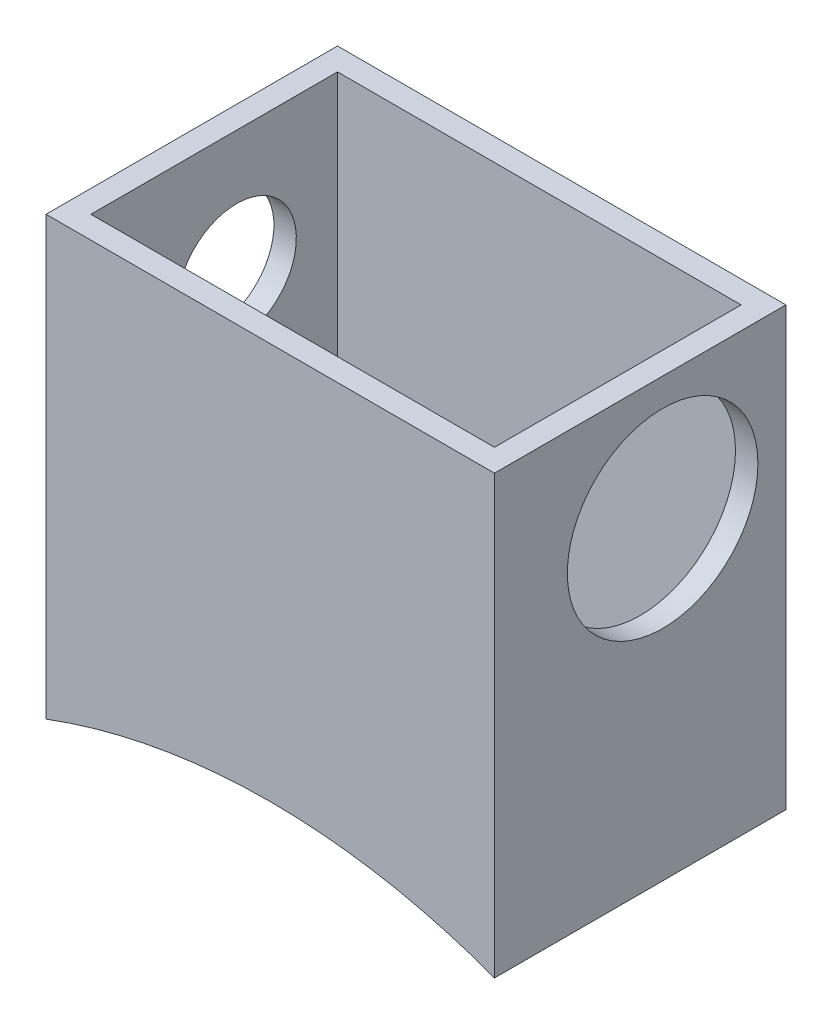
ISO-10303-21;
HEADER;
FILE_DESCRIPTION(('STEP AP214'),'2;1');
FILE_NAME('part.step','',(''),(''),'','','');
FILE_SCHEMA(('AUTOMOTIVE_DESIGN { 1 0 10303 214 1 1 1 1 }'));
ENDSEC;
DATA;
#1=APPLICATION_CONTEXT('core data for automotive mechanical design processes');
#2=APPLICATION_PROTOCOL_DEFINITION('international standard','automotive_design',2000,#1);
#3=PRODUCT_CONTEXT('',#1,'mechanical');
#4=PRODUCT('Part','Part','',(#3));
#5=PRODUCT_RELATED_PRODUCT_CATEGORY('part','',(#4));
#6=PRODUCT_DEFINITION_FORMATION('','',#4);
#7=PRODUCT_DEFINITION_CONTEXT('part definition',#1,'design');
#8=PRODUCT_DEFINITION('design','',#6,#7);
#9=PRODUCT_DEFINITION_SHAPE('','',#8);
#10=(LENGTH_UNIT() NAMED_UNIT(*) SI_UNIT(.MILLI.,.METRE.));
#11=(NAMED_UNIT(*) PLANE_ANGLE_UNIT() SI_UNIT($,.RADIAN.));
#12=(NAMED_UNIT(*) SI_UNIT($,.STERADIAN.) SOLID_ANGLE_UNIT());
#13=UNCERTAINTY_MEASURE_WITH_UNIT(LENGTH_MEASURE(1.E-05),#10,'distance_accuracy_value','');
#14=(GEOMETRIC_REPRESENTATION_CONTEXT(3) GLOBAL_UNCERTAINTY_ASSIGNED_CONTEXT((#13)) GLOBAL_UNIT_ASSIGNED_CONTEXT((#10,
#11,#12)) REPRESENTATION_CONTEXT('',''));
#15=CARTESIAN_POINT('',(0.,0.,0.));
#16=DIRECTION('',(0.,0.,1.));
#17=DIRECTION('',(1.,0.,0.));
#18=AXIS2_PLACEMENT_3D('',#15,#16,#17);
#19=CARTESIAN_POINT('',(6.29812676056338,7.63468869899953,5.588));
#20=DIRECTION('',(1.,0.,0.));
#21=DIRECTION('',(0.,0.,-1.));
#22=AXIS2_PLACEMENT_3D('',#19,#20,#21);
#23=PLANE('',#22);
#24=CARTESIAN_POINT('',(6.29812676056338,4.84068869899953,2.794));
#25=DIRECTION('',(1.,0.,0.));
#26=DIRECTION('',(0.,0.,-1.));
#27=AXIS2_PLACEMENT_3D('',#24,#25,#26);
#28=CIRCLE('',#27,2.159);
#29=CARTESIAN_POINT('',(6.29812676056338,4.84068869899953,0.635000000000001));
#30=VERTEX_POINT('',#29);
#31=EDGE_CURVE('E172',#30,#30,#28,.F.);
#32=ORIENTED_EDGE('',*,*,#31,.F.);
#33=EDGE_LOOP('',(#32));
#34=FACE_BOUND('',#33,.T.);
#35=DIRECTION('',(0.,-1.,0.));
#36=VECTOR('',#35,1.);
#37=CARTESIAN_POINT('',(6.29812676056338,7.63468869899953,0.508));
#38=LINE('',#37,#36);
#39=CARTESIAN_POINT('',(6.29812676056338,7.63468869899953,0.508));
#40=VERTEX_POINT('',#39);
#41=CARTESIAN_POINT('',(6.29812676056338,-0.747311301000474,0.508));
#42=VERTEX_POINT('',#41);
#43=EDGE_CURVE('E55',#40,#42,#38,.T.);
#44=ORIENTED_EDGE('',*,*,#43,.T.);
#45=DIRECTION('',(0.,0.,-1.));
#46=VECTOR('',#45,1.);
#47=CARTESIAN_POINT('',(6.29812676056338,-0.747311301000474,5.588));
#48=LINE('',#47,#46);
#49=CARTESIAN_POINT('',(6.29812676056338,-0.747311301000474,6.096));
#50=VERTEX_POINT('',#49);
#51=EDGE_CURVE('E136',#50,#42,#48,.T.);
#52=ORIENTED_EDGE('',*,*,#51,.F.);
#53=DIRECTION('',(0.,1.,0.));
#54=VECTOR('',#53,1.);
#55=CARTESIAN_POINT('',(6.29812676056338,-0.747311301000474,6.096));
#56=LINE('',#55,#54);
#57=CARTESIAN_POINT('',(6.29812676056338,7.63468869899953,6.096));
#58=VERTEX_POINT('',#57);
#59=EDGE_CURVE('E207',#50,#58,#56,.T.);
#60=ORIENTED_EDGE('',*,*,#59,.T.);
#61=DIRECTION('',(0.,0.,-1.));
#62=VECTOR('',#61,1.);
#63=CARTESIAN_POINT('',(6.29812676056338,7.63468869899953,5.588));
#64=LINE('',#63,#62);
#65=EDGE_CURVE('E124',#58,#40,#64,.T.);
#66=ORIENTED_EDGE('',*,*,#65,.T.);
#67=EDGE_LOOP('',(#44,#52,#60,#66));
#68=FACE_BOUND('',#67,.T.);
#69=ADVANCED_FACE('F39',(#34,#68),#23,.F.);
#70=CARTESIAN_POINT('',(6.29812676056338,-0.747311301000474,5.588));
#71=DIRECTION('',(0.,-1.,0.));
#72=DIRECTION('',(1.,0.,0.));
#73=AXIS2_PLACEMENT_3D('',#70,#71,#72);
#74=PLANE('',#73);
#75=DIRECTION('',(-1.,0.,0.));
#76=VECTOR('',#75,1.);
#77=CARTESIAN_POINT('',(6.29812676056338,-0.747311301000474,0.508));
#78=LINE('',#77,#76);
#79=CARTESIAN_POINT('',(-2.84587323943662,-0.747311301000475,0.508));
#80=VERTEX_POINT('',#79);
#81=EDGE_CURVE('E62',#42,#80,#78,.T.);
#82=ORIENTED_EDGE('',*,*,#81,.T.);
#83=DIRECTION('',(0.,0.,-1.));
#84=VECTOR('',#83,1.);
#85=CARTESIAN_POINT('',(-2.84587323943662,-0.747311301000475,5.588));
#86=LINE('',#85,#84);
#87=CARTESIAN_POINT('',(-2.84587323943662,-0.747311301000474,6.096));
#88=VERTEX_POINT('',#87);
#89=EDGE_CURVE('E131',#88,#80,#86,.T.);
#90=ORIENTED_EDGE('',*,*,#89,.F.);
#91=DIRECTION('',(1.,0.,0.));
#92=VECTOR('',#91,1.);
#93=CARTESIAN_POINT('',(-2.84587323943662,-0.747311301000474,6.096));
#94=LINE('',#93,#92);
#95=EDGE_CURVE('E112',#88,#50,#94,.T.);
#96=ORIENTED_EDGE('',*,*,#95,.T.);
#97=ORIENTED_EDGE('',*,*,#51,.T.);
#98=EDGE_LOOP('',(#82,#90,#96,#97));
#99=FACE_BOUND('',#98,.T.);
#100=ADVANCED_FACE('F230',(#99),#74,.F.);
#101=CARTESIAN_POINT('',(-2.84587323943662,-0.747311301000475,5.588));
#102=DIRECTION('',(-1.,0.,0.));
#103=DIRECTION('',(0.,-1.,0.));
#104=AXIS2_PLACEMENT_3D('',#101,#102,#103);
#105=PLANE('',#104);
#106=CARTESIAN_POINT('',(-2.84587323943662,4.84068869899953,2.794));
#107=DIRECTION('',(-1.,0.,0.));
#108=DIRECTION('',(0.,-1.,0.));
#109=AXIS2_PLACEMENT_3D('',#106,#107,#108);
#110=CIRCLE('',#109,1.35254999999999);
#111=CARTESIAN_POINT('',(-2.84587323943662,3.48813869899953,2.794));
#112=VERTEX_POINT('',#111);
#113=EDGE_CURVE('E177',#112,#112,#110,.T.);
#114=ORIENTED_EDGE('',*,*,#113,.T.);
#115=EDGE_LOOP('',(#114));
#116=FACE_BOUND('',#115,.T.);
#117=DIRECTION('',(0.,1.,0.));
#118=VECTOR('',#117,1.);
#119=CARTESIAN_POINT('',(-2.84587323943662,-0.747311301000474,0.508));
#120=LINE('',#119,#118);
#121=CARTESIAN_POINT('',(-2.84587323943662,7.63468869899953,0.508));
#122=VERTEX_POINT('',#121);
#123=EDGE_CURVE('E129',#80,#122,#120,.T.);
#124=ORIENTED_EDGE('',*,*,#123,.T.);
#125=DIRECTION('',(0.,0.,-1.));
#126=VECTOR('',#125,1.);
#127=CARTESIAN_POINT('',(-2.84587323943662,7.63468869899953,5.588));
#128=LINE('',#127,#126);
#129=CARTESIAN_POINT('',(-2.84587323943662,7.63468869899953,6.096));
#130=VERTEX_POINT('',#129);
#131=EDGE_CURVE('E122',#130,#122,#128,.T.);
#132=ORIENTED_EDGE('',*,*,#131,.F.);
#133=DIRECTION('',(0.,-1.,0.));
#134=VECTOR('',#133,1.);
#135=CARTESIAN_POINT('',(-2.84587323943662,7.63468869899953,6.096));
#136=LINE('',#135,#134);
#137=EDGE_CURVE('E106',#130,#88,#136,.T.);
#138=ORIENTED_EDGE('',*,*,#137,.T.);
#139=ORIENTED_EDGE('',*,*,#89,.T.);
#140=EDGE_LOOP('',(#124,#132,#138,#139));
#141=FACE_BOUND('',#140,.T.);
#142=ADVANCED_FACE('F127',(#116,#141),#105,.F.);
#143=CARTESIAN_POINT('',(-3.35387323943662,7.63468869899953,5.588));
#144=DIRECTION('',(1.,0.,0.));
#145=DIRECTION('',(0.,0.,-1.));
#146=AXIS2_PLACEMENT_3D('',#143,#144,#145);
#147=PLANE('',#146);
#148=DIRECTION('',(0.,-1.,0.));
#149=VECTOR('',#148,1.);
#150=CARTESIAN_POINT('',(-3.35387323943662,7.63468869899953,0.));
#151=LINE('',#150,#149);
#152=CARTESIAN_POINT('',(-3.35387323943662,7.63468869899953,0.));
#153=VERTEX_POINT('',#152);
#154=CARTESIAN_POINT('',(-3.35387323943662,-2.27131130100047,0.));
#155=VERTEX_POINT('',#154);
#156=EDGE_CURVE('E170',#153,#155,#151,.T.);
#157=ORIENTED_EDGE('',*,*,#156,.T.);
#158=DIRECTION('',(0.,0.,-1.));
#159=VECTOR('',#158,1.);
#160=CARTESIAN_POINT('',(-3.35387323943662,-2.27131130100047,5.588));
#161=LINE('',#160,#159);
#162=CARTESIAN_POINT('',(-3.35387323943662,-2.27131130100047,6.604));
#163=VERTEX_POINT('',#162);
#164=EDGE_CURVE('E48',#163,#155,#161,.T.);
#165=ORIENTED_EDGE('',*,*,#164,.F.);
#166=DIRECTION('',(0.,-1.,0.));
#167=VECTOR('',#166,1.);
#168=CARTESIAN_POINT('',(-3.35387323943662,7.63468869899953,6.604));
#169=LINE('',#168,#167);
#170=CARTESIAN_POINT('',(-3.35387323943662,7.63468869899953,6.604));
#171=VERTEX_POINT('',#170);
#172=EDGE_CURVE('E197',#171,#163,#169,.T.);
#173=ORIENTED_EDGE('',*,*,#172,.F.);
#174=DIRECTION('',(0.,0.,-1.));
#175=VECTOR('',#174,1.);
#176=CARTESIAN_POINT('',(-3.35387323943662,7.63468869899953,5.588));
#177=LINE('',#176,#175);
#178=EDGE_CURVE('E11',#171,#153,#177,.T.);
#179=ORIENTED_EDGE('',*,*,#178,.T.);
#180=EDGE_LOOP('',(#157,#165,#173,#179));
#181=FACE_BOUND('',#180,.T.);
#182=CARTESIAN_POINT('',(-3.35387323943662,4.84068869899953,2.794));
#183=DIRECTION('',(-1.,0.,0.));
#184=DIRECTION('',(0.,0.,1.));
#185=AXIS2_PLACEMENT_3D('',#182,#183,#184);
#186=CIRCLE('',#185,1.35254999999999);
#187=CARTESIAN_POINT('',(-3.35387323943662,4.84068869899953,4.14654999999999));
#188=VERTEX_POINT('',#187);
#189=EDGE_CURVE('E182',#188,#188,#186,.T.);
#190=ORIENTED_EDGE('',*,*,#189,.F.);
#191=EDGE_LOOP('',(#190));
#192=FACE_BOUND('',#191,.T.);
#193=ADVANCED_FACE('F41',(#181,#192),#147,.F.);
#194=CARTESIAN_POINT('',(6.80612676056338,-2.27131130100047,5.588));
#195=DIRECTION('',(-1.,0.,0.));
#196=DIRECTION('',(0.,0.,1.));
#197=AXIS2_PLACEMENT_3D('',#194,#195,#196);
#198=PLANE('',#197);
#199=CARTESIAN_POINT('',(6.80612676056338,4.84068869899953,2.794));
#200=DIRECTION('',(1.,0.,0.));
#201=DIRECTION('',(0.,0.,-1.));
#202=AXIS2_PLACEMENT_3D('',#199,#200,#201);
#203=CIRCLE('',#202,2.159);
#204=CARTESIAN_POINT('',(6.80612676056338,4.84068869899953,0.635000000000001));
#205=VERTEX_POINT('',#204);
#206=EDGE_CURVE('E188',#205,#205,#203,.T.);
#207=ORIENTED_EDGE('',*,*,#206,.F.);
#208=EDGE_LOOP('',(#207));
#209=FACE_BOUND('',#208,.T.);
#210=DIRECTION('',(0.,1.,0.));
#211=VECTOR('',#210,1.);
#212=CARTESIAN_POINT('',(6.80612676056338,-2.27131130100047,0.));
#213=LINE('',#212,#211);
#214=CARTESIAN_POINT('',(6.80612676056338,-2.27131130100047,0.));
#215=VERTEX_POINT('',#214);
#216=CARTESIAN_POINT('',(6.80612676056338,7.63468869899953,0.));
#217=VERTEX_POINT('',#216);
#218=EDGE_CURVE('E138',#215,#217,#213,.T.);
#219=ORIENTED_EDGE('',*,*,#218,.T.);
#220=DIRECTION('',(0.,0.,-1.));
#221=VECTOR('',#220,1.);
#222=CARTESIAN_POINT('',(6.80612676056338,7.63468869899953,5.588));
#223=LINE('',#222,#221);
#224=CARTESIAN_POINT('',(6.80612676056338,7.63468869899953,6.604));
#225=VERTEX_POINT('',#224);
#226=EDGE_CURVE('E146',#225,#217,#223,.T.);
#227=ORIENTED_EDGE('',*,*,#226,.F.);
#228=DIRECTION('',(0.,1.,0.));
#229=VECTOR('',#228,1.);
#230=CARTESIAN_POINT('',(6.80612676056338,-2.27131130100047,6.604));
#231=LINE('',#230,#229);
#232=CARTESIAN_POINT('',(6.80612676056338,-2.27131130100047,6.604));
#233=VERTEX_POINT('',#232);
#234=EDGE_CURVE('E203',#233,#225,#231,.T.);
#235=ORIENTED_EDGE('',*,*,#234,.F.);
#236=DIRECTION('',(0.,0.,-1.));
#237=VECTOR('',#236,1.);
#238=CARTESIAN_POINT('',(6.80612676056338,-2.27131130100047,5.588));
#239=LINE('',#238,#237);
#240=EDGE_CURVE('E150',#233,#215,#239,.T.);
#241=ORIENTED_EDGE('',*,*,#240,.T.);
#242=EDGE_LOOP('',(#219,#227,#235,#241));
#243=FACE_BOUND('',#242,.T.);
#244=ADVANCED_FACE('F241',(#209,#243),#198,.F.);
#245=CARTESIAN_POINT('',(6.29812676056338,7.63468869899953,5.588));
#246=DIRECTION('',(0.,-1.,0.));
#247=DIRECTION('',(0.,0.,-1.));
#248=AXIS2_PLACEMENT_3D('',#245,#246,#247);
#249=PLANE('',#248);
#250=DIRECTION('',(-1.,0.,0.));
#251=VECTOR('',#250,1.);
#252=CARTESIAN_POINT('',(6.29812676056338,7.63468869899953,0.));
#253=LINE('',#252,#251);
#254=EDGE_CURVE('E132',#217,#153,#253,.T.);
#255=ORIENTED_EDGE('',*,*,#254,.T.);
#256=ORIENTED_EDGE('',*,*,#178,.F.);
#257=DIRECTION('',(-1.,0.,0.));
#258=VECTOR('',#257,1.);
#259=CARTESIAN_POINT('',(6.80612676056338,7.63468869899953,6.604));
#260=LINE('',#259,#258);
#261=EDGE_CURVE('E200',#225,#171,#260,.T.);
#262=ORIENTED_EDGE('',*,*,#261,.F.);
#263=ORIENTED_EDGE('',*,*,#226,.T.);
#264=EDGE_LOOP('',(#255,#256,#262,#263));
#265=FACE_BOUND('',#264,.T.);
#266=DIRECTION('',(1.,0.,0.));
#267=VECTOR('',#266,1.);
#268=CARTESIAN_POINT('',(-2.84587323943662,7.63468869899953,0.508));
#269=LINE('',#268,#267);
#270=EDGE_CURVE('E214',#122,#40,#269,.T.);
#271=ORIENTED_EDGE('',*,*,#270,.T.);
#272=ORIENTED_EDGE('',*,*,#65,.F.);
#273=DIRECTION('',(-1.,0.,0.));
#274=VECTOR('',#273,1.);
#275=CARTESIAN_POINT('',(6.29812676056338,7.63468869899953,6.096));
#276=LINE('',#275,#274);
#277=EDGE_CURVE('E109',#58,#130,#276,.T.);
#278=ORIENTED_EDGE('',*,*,#277,.T.);
#279=ORIENTED_EDGE('',*,*,#131,.T.);
#280=EDGE_LOOP('',(#271,#272,#278,#279));
#281=FACE_BOUND('',#280,.T.);
#282=ADVANCED_FACE('F121',(#265,#281),#249,.F.);
#283=CARTESIAN_POINT('',(0.,0.,0.));
#284=DIRECTION('',(0.,0.,1.));
#285=DIRECTION('',(1.,0.,0.));
#286=AXIS2_PLACEMENT_3D('',#283,#284,#285);
#287=PLANE('',#286);
#288=ORIENTED_EDGE('',*,*,#218,.F.);
#289=CARTESIAN_POINT('',(1.72612676056338,-15.8288215444043,0.));
#290=DIRECTION('',(0.,0.,-1.));
#291=DIRECTION('',(1.,0.,0.));
#292=AXIS2_PLACEMENT_3D('',#289,#290,#291);
#293=CIRCLE('',#292,14.478);
#294=EDGE_CURVE('E158',#155,#215,#293,.T.);
#295=ORIENTED_EDGE('',*,*,#294,.F.);
#296=ORIENTED_EDGE('',*,*,#156,.F.);
#297=ORIENTED_EDGE('',*,*,#254,.F.);
#298=EDGE_LOOP('',(#288,#295,#296,#297));
#299=FACE_BOUND('',#298,.T.);
#300=ADVANCED_FACE('F168',(#299),#287,.F.);
#301=CARTESIAN_POINT('',(-3.35387323943662,4.84068869899953,2.794));
#302=DIRECTION('',(-1.,0.,0.));
#303=DIRECTION('',(0.,0.,1.));
#304=AXIS2_PLACEMENT_3D('',#301,#302,#303);
#305=CYLINDRICAL_SURFACE('',#304,1.35254999999999);
#306=ORIENTED_EDGE('',*,*,#113,.F.);
#307=EDGE_LOOP('',(#306));
#308=FACE_BOUND('',#307,.T.);
#309=ORIENTED_EDGE('',*,*,#189,.T.);
#310=EDGE_LOOP('',(#309));
#311=FACE_BOUND('',#310,.T.);
#312=ADVANCED_FACE('F263',(#308,#311),#305,.F.);
#313=CARTESIAN_POINT('',(-3.35487323943662,4.84068869899953,2.794));
#314=DIRECTION('',(1.,0.,0.));
#315=DIRECTION('',(0.,0.,-1.));
#316=AXIS2_PLACEMENT_3D('',#313,#314,#315);
#317=CYLINDRICAL_SURFACE('',#316,2.159);
#318=ORIENTED_EDGE('',*,*,#206,.T.);
#319=EDGE_LOOP('',(#318));
#320=FACE_BOUND('',#319,.T.);
#321=ORIENTED_EDGE('',*,*,#31,.T.);
#322=EDGE_LOOP('',(#321));
#323=FACE_BOUND('',#322,.T.);
#324=ADVANCED_FACE('F258',(#320,#323),#317,.F.);
#325=CARTESIAN_POINT('',(1.72612676056338,-15.8288215444043,5.588));
#326=DIRECTION('',(0.,0.,-1.));
#327=DIRECTION('',(-1.,0.,0.));
#328=AXIS2_PLACEMENT_3D('',#325,#326,#327);
#329=CYLINDRICAL_SURFACE('',#328,14.478);
#330=ORIENTED_EDGE('',*,*,#294,.T.);
#331=ORIENTED_EDGE('',*,*,#240,.F.);
#332=CARTESIAN_POINT('',(1.72612676056338,-15.8288215444043,6.604));
#333=DIRECTION('',(0.,0.,-1.));
#334=DIRECTION('',(-1.,0.,0.));
#335=AXIS2_PLACEMENT_3D('',#332,#333,#334);
#336=CIRCLE('',#335,14.478);
#337=EDGE_CURVE('E160',#163,#233,#336,.T.);
#338=ORIENTED_EDGE('',*,*,#337,.F.);
#339=ORIENTED_EDGE('',*,*,#164,.T.);
#340=EDGE_LOOP('',(#330,#331,#338,#339));
#341=FACE_BOUND('',#340,.T.);
#342=ADVANCED_FACE('F157',(#341),#329,.F.);
#343=CARTESIAN_POINT('',(1.72612676056338,-15.8288215444043,6.604));
#344=DIRECTION('',(0.,0.,-1.));
#345=DIRECTION('',(-1.,0.,0.));
#346=AXIS2_PLACEMENT_3D('',#343,#344,#345);
#347=PLANE('',#346);
#348=ORIENTED_EDGE('',*,*,#261,.T.);
#349=ORIENTED_EDGE('',*,*,#172,.T.);
#350=ORIENTED_EDGE('',*,*,#337,.T.);
#351=ORIENTED_EDGE('',*,*,#234,.T.);
#352=EDGE_LOOP('',(#348,#349,#350,#351));
#353=FACE_BOUND('',#352,.T.);
#354=ADVANCED_FACE('F227',(#353),#347,.F.);
#355=CARTESIAN_POINT('',(0.,0.,6.096));
#356=DIRECTION('',(0.,0.,1.));
#357=DIRECTION('',(1.,0.,0.));
#358=AXIS2_PLACEMENT_3D('',#355,#356,#357);
#359=PLANE('',#358);
#360=ORIENTED_EDGE('',*,*,#277,.F.);
#361=ORIENTED_EDGE('',*,*,#59,.F.);
#362=ORIENTED_EDGE('',*,*,#95,.F.);
#363=ORIENTED_EDGE('',*,*,#137,.F.);
#364=EDGE_LOOP('',(#360,#361,#362,#363));
#365=FACE_BOUND('',#364,.T.);
#366=ADVANCED_FACE('F108',(#365),#359,.F.);
#367=CARTESIAN_POINT('',(0.,0.,0.508));
#368=DIRECTION('',(0.,0.,-1.));
#369=DIRECTION('',(-1.,0.,0.));
#370=AXIS2_PLACEMENT_3D('',#367,#368,#369);
#371=PLANE('',#370);
#372=ORIENTED_EDGE('',*,*,#81,.F.);
#373=ORIENTED_EDGE('',*,*,#43,.F.);
#374=ORIENTED_EDGE('',*,*,#270,.F.);
#375=ORIENTED_EDGE('',*,*,#123,.F.);
#376=EDGE_LOOP('',(#372,#373,#374,#375));
#377=FACE_BOUND('',#376,.T.);
#378=ADVANCED_FACE('F221',(#377),#371,.F.);
#379=CLOSED_SHELL('',(#69,#100,#142,#193,#244,#282,#300,#312,#324,#342,#354,#366,#378));
#380=MANIFOLD_SOLID_BREP('B2',#379);
#381=ADVANCED_BREP_SHAPE_REPRESENTATION('',(#18,#380),#14);
#382=SHAPE_DEFINITION_REPRESENTATION(#9,#381);
ENDSEC;
END-ISO-10303-21;
